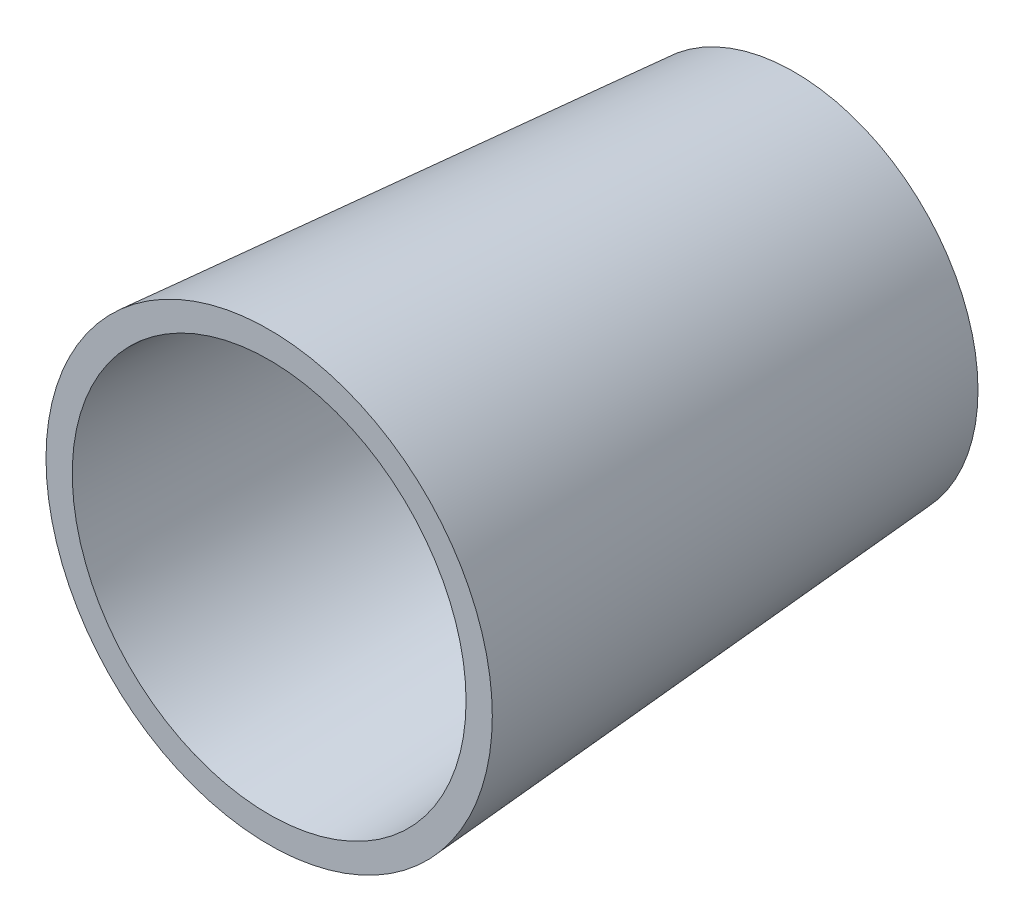
ISO-10303-21;
HEADER;
FILE_DESCRIPTION(('STEP AP214'),'2;1');
FILE_NAME('part.step','',(''),(''),'','','');
FILE_SCHEMA(('AUTOMOTIVE_DESIGN { 1 0 10303 214 1 1 1 1 }'));
ENDSEC;
DATA;
#1=APPLICATION_CONTEXT('core data for automotive mechanical design processes');
#2=APPLICATION_PROTOCOL_DEFINITION('international standard','automotive_design',2000,#1);
#3=PRODUCT_CONTEXT('',#1,'mechanical');
#4=PRODUCT('Part','Part','',(#3));
#5=PRODUCT_RELATED_PRODUCT_CATEGORY('part','',(#4));
#6=PRODUCT_DEFINITION_FORMATION('','',#4);
#7=PRODUCT_DEFINITION_CONTEXT('part definition',#1,'design');
#8=PRODUCT_DEFINITION('design','',#6,#7);
#9=PRODUCT_DEFINITION_SHAPE('','',#8);
#10=(LENGTH_UNIT() NAMED_UNIT(*) SI_UNIT(.MILLI.,.METRE.));
#11=(NAMED_UNIT(*) PLANE_ANGLE_UNIT() SI_UNIT($,.RADIAN.));
#12=(NAMED_UNIT(*) SI_UNIT($,.STERADIAN.) SOLID_ANGLE_UNIT());
#13=UNCERTAINTY_MEASURE_WITH_UNIT(LENGTH_MEASURE(1.E-05),#10,'distance_accuracy_value','');
#14=(GEOMETRIC_REPRESENTATION_CONTEXT(3) GLOBAL_UNCERTAINTY_ASSIGNED_CONTEXT((#13)) GLOBAL_UNIT_ASSIGNED_CONTEXT((#10,
#11,#12)) REPRESENTATION_CONTEXT('',''));
#15=CARTESIAN_POINT('',(0.,0.,0.));
#16=DIRECTION('',(0.,0.,1.));
#17=DIRECTION('',(1.,0.,0.));
#18=AXIS2_PLACEMENT_3D('',#15,#16,#17);
#19=CARTESIAN_POINT('',(0.,0.,3.));
#20=DIRECTION('',(0.,0.,-1.));
#21=DIRECTION('',(-1.,0.,0.));
#22=AXIS2_PLACEMENT_3D('',#19,#20,#21);
#23=CYLINDRICAL_SURFACE('',#22,32.5);
#24=CARTESIAN_POINT('',(0.,0.,3.));
#25=DIRECTION('',(0.,0.,-1.));
#26=DIRECTION('',(-1.,0.,0.));
#27=AXIS2_PLACEMENT_3D('',#24,#25,#26);
#28=CIRCLE('',#27,32.5);
#29=CARTESIAN_POINT('',(-32.5,0.,3.));
#30=VERTEX_POINT('',#29);
#31=EDGE_CURVE('E12',#30,#30,#28,.T.);
#32=ORIENTED_EDGE('',*,*,#31,.T.);
#33=EDGE_LOOP('',(#32));
#34=FACE_BOUND('',#33,.T.);
#35=CARTESIAN_POINT('',(0.,0.,0.));
#36=DIRECTION('',(0.,0.,-1.));
#37=DIRECTION('',(-1.,0.,0.));
#38=AXIS2_PLACEMENT_3D('',#35,#36,#37);
#39=CIRCLE('',#38,32.5);
#40=CARTESIAN_POINT('',(-32.5,0.,0.));
#41=VERTEX_POINT('',#40);
#42=EDGE_CURVE('E58',#41,#41,#39,.T.);
#43=ORIENTED_EDGE('',*,*,#42,.F.);
#44=EDGE_LOOP('',(#43));
#45=FACE_BOUND('',#44,.T.);
#46=ADVANCED_FACE('F55',(#34,#45),#23,.T.);
#47=CARTESIAN_POINT('',(0.,0.,3.));
#48=DIRECTION('',(0.,0.,-1.));
#49=DIRECTION('',(-1.,0.,0.));
#50=AXIS2_PLACEMENT_3D('',#47,#48,#49);
#51=PLANE('',#50);
#52=ORIENTED_EDGE('',*,*,#31,.F.);
#53=EDGE_LOOP('',(#52));
#54=FACE_BOUND('',#53,.T.);
#55=ADVANCED_FACE('F70',(#54),#51,.F.);
#56=CARTESIAN_POINT('',(0.,0.,0.));
#57=DIRECTION('',(0.,0.,-1.));
#58=DIRECTION('',(-1.,0.,0.));
#59=AXIS2_PLACEMENT_3D('',#56,#57,#58);
#60=PLANE('',#59);
#61=ORIENTED_EDGE('',*,*,#42,.T.);
#62=EDGE_LOOP('',(#61));
#63=FACE_BOUND('',#62,.T.);
#64=ADVANCED_FACE('F67',(#63),#60,.T.);
#65=CLOSED_SHELL('',(#46,#55,#64));
#66=MANIFOLD_SOLID_BREP('B2',#65);
#67=CARTESIAN_POINT('',(0.,0.,0.));
#68=DIRECTION('',(0.,0.,1.));
#69=DIRECTION('',(1.,0.,0.));
#70=AXIS2_PLACEMENT_3D('',#67,#68,#69);
#71=PLANE('',#70);
#72=CARTESIAN_POINT('',(0.,0.,0.));
#73=DIRECTION('',(0.,0.,1.));
#74=DIRECTION('',(1.,0.,0.));
#75=AXIS2_PLACEMENT_3D('',#72,#73,#74);
#76=CIRCLE('',#75,32.5);
#77=CARTESIAN_POINT('',(32.5,0.,0.));
#78=VERTEX_POINT('',#77);
#79=EDGE_CURVE('E111',#78,#78,#76,.T.);
#80=ORIENTED_EDGE('',*,*,#79,.T.);
#81=EDGE_LOOP('',(#80));
#82=FACE_BOUND('',#81,.T.);
#83=CARTESIAN_POINT('',(0.,0.,0.));
#84=DIRECTION('',(0.,0.,1.));
#85=DIRECTION('',(1.,0.,0.));
#86=AXIS2_PLACEMENT_3D('',#83,#84,#85);
#87=CIRCLE('',#86,35.);
#88=CARTESIAN_POINT('',(35.,0.,0.));
#89=VERTEX_POINT('',#88);
#90=EDGE_CURVE('E54',#89,#89,#87,.T.);
#91=ORIENTED_EDGE('',*,*,#90,.F.);
#92=EDGE_LOOP('',(#91));
#93=FACE_BOUND('',#92,.T.);
#94=ADVANCED_FACE('F96',(#82,#93),#71,.F.);
#95=CARTESIAN_POINT('',(0.,0.,100.));
#96=DIRECTION('',(0.,0.,1.));
#97=DIRECTION('',(1.,0.,0.));
#98=AXIS2_PLACEMENT_3D('',#95,#96,#97);
#99=PLANE('',#98);
#100=CARTESIAN_POINT('',(0.,0.,100.));
#101=DIRECTION('',(0.,0.,1.));
#102=DIRECTION('',(1.,0.,0.));
#103=AXIS2_PLACEMENT_3D('',#100,#101,#102);
#104=CIRCLE('',#103,37.5);
#105=CARTESIAN_POINT('',(37.5,0.,100.));
#106=VERTEX_POINT('',#105);
#107=EDGE_CURVE('E168',#106,#106,#104,.T.);
#108=ORIENTED_EDGE('',*,*,#107,.F.);
#109=EDGE_LOOP('',(#108));
#110=FACE_BOUND('',#109,.T.);
#111=CARTESIAN_POINT('',(0.,0.,100.));
#112=DIRECTION('',(0.,0.,1.));
#113=DIRECTION('',(1.,0.,0.));
#114=AXIS2_PLACEMENT_3D('',#111,#112,#113);
#115=CIRCLE('',#114,42.5);
#116=CARTESIAN_POINT('',(42.5,0.,100.));
#117=VERTEX_POINT('',#116);
#118=EDGE_CURVE('E105',#117,#117,#115,.T.);
#119=ORIENTED_EDGE('',*,*,#118,.T.);
#120=EDGE_LOOP('',(#119));
#121=FACE_BOUND('',#120,.T.);
#122=ADVANCED_FACE('F131',(#110,#121),#99,.T.);
#123=CARTESIAN_POINT('',(0.,0.,0.));
#124=DIRECTION('',(0.,0.,1.));
#125=DIRECTION('',(1.,0.,0.));
#126=AXIS2_PLACEMENT_3D('',#123,#124,#125);
#127=CONICAL_SURFACE('',#126,35.,0.0748598477107668);
#128=ORIENTED_EDGE('',*,*,#118,.F.);
#129=EDGE_LOOP('',(#128));
#130=FACE_BOUND('',#129,.T.);
#131=ORIENTED_EDGE('',*,*,#90,.T.);
#132=EDGE_LOOP('',(#131));
#133=FACE_BOUND('',#132,.T.);
#134=ADVANCED_FACE('F140',(#130,#133),#127,.T.);
#135=CARTESIAN_POINT('',(0.,0.,0.));
#136=DIRECTION('',(0.,0.,1.));
#137=DIRECTION('',(1.,0.,0.));
#138=AXIS2_PLACEMENT_3D('',#135,#136,#137);
#139=CONICAL_SURFACE('',#138,32.5,0.0499583957219428);
#140=ORIENTED_EDGE('',*,*,#107,.T.);
#141=EDGE_LOOP('',(#140));
#142=FACE_BOUND('',#141,.T.);
#143=ORIENTED_EDGE('',*,*,#79,.F.);
#144=EDGE_LOOP('',(#143));
#145=FACE_BOUND('',#144,.T.);
#146=ADVANCED_FACE('F142',(#142,#145),#139,.F.);
#147=CLOSED_SHELL('',(#94,#122,#134,#146));
#148=MANIFOLD_SOLID_BREP('B7',#147);
#149=ADVANCED_BREP_SHAPE_REPRESENTATION('',(#18,#66,#148),#14);
#150=SHAPE_DEFINITION_REPRESENTATION(#9,#149);
ENDSEC;
END-ISO-10303-21;
